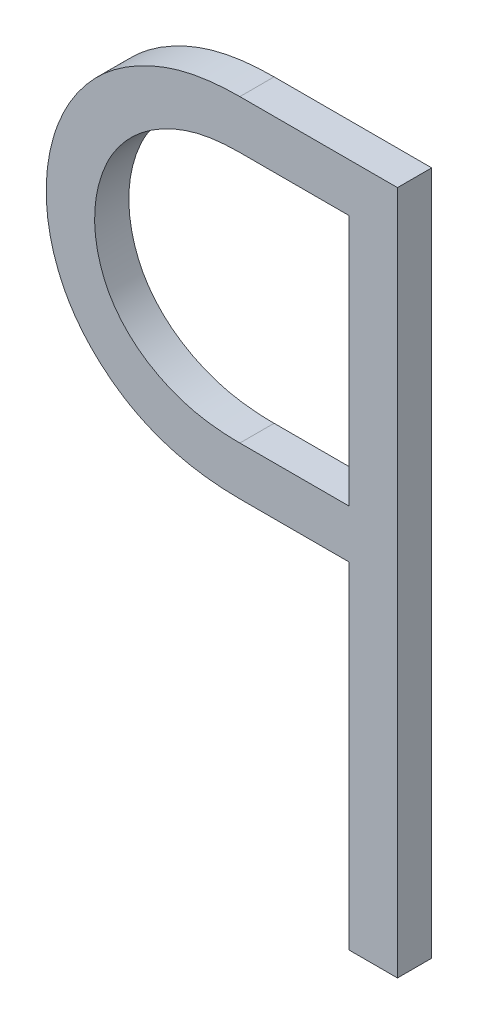
ISO-10303-21;
HEADER;
FILE_DESCRIPTION(('STEP AP214'),'2;1');
FILE_NAME('part.step','',(''),(''),'','','');
FILE_SCHEMA(('AUTOMOTIVE_DESIGN { 1 0 10303 214 1 1 1 1 }'));
ENDSEC;
DATA;
#1=APPLICATION_CONTEXT('core data for automotive mechanical design processes');
#2=APPLICATION_PROTOCOL_DEFINITION('international standard','automotive_design',2000,#1);
#3=PRODUCT_CONTEXT('',#1,'mechanical');
#4=PRODUCT('Part','Part','',(#3));
#5=PRODUCT_RELATED_PRODUCT_CATEGORY('part','',(#4));
#6=PRODUCT_DEFINITION_FORMATION('','',#4);
#7=PRODUCT_DEFINITION_CONTEXT('part definition',#1,'design');
#8=PRODUCT_DEFINITION('design','',#6,#7);
#9=PRODUCT_DEFINITION_SHAPE('','',#8);
#10=(LENGTH_UNIT() NAMED_UNIT(*) SI_UNIT(.MILLI.,.METRE.));
#11=(NAMED_UNIT(*) PLANE_ANGLE_UNIT() SI_UNIT($,.RADIAN.));
#12=(NAMED_UNIT(*) SI_UNIT($,.STERADIAN.) SOLID_ANGLE_UNIT());
#13=UNCERTAINTY_MEASURE_WITH_UNIT(LENGTH_MEASURE(1.E-05),#10,'distance_accuracy_value','');
#14=(GEOMETRIC_REPRESENTATION_CONTEXT(3) GLOBAL_UNCERTAINTY_ASSIGNED_CONTEXT((#13)) GLOBAL_UNIT_ASSIGNED_CONTEXT((#10,
#11,#12)) REPRESENTATION_CONTEXT('',''));
#15=CARTESIAN_POINT('',(0.,0.,0.));
#16=DIRECTION('',(0.,0.,1.));
#17=DIRECTION('',(1.,0.,0.));
#18=AXIS2_PLACEMENT_3D('',#15,#16,#17);
#19=CARTESIAN_POINT('',(76.9260426261496,67.2664998479739,-39.1));
#20=DIRECTION('',(0.,0.,-1.));
#21=DIRECTION('',(-1.,0.,0.));
#22=AXIS2_PLACEMENT_3D('',#19,#20,#21);
#23=PLANE('',#22);
#24=DIRECTION('',(0.,1.,0.));
#25=VECTOR('',#24,1.);
#26=CARTESIAN_POINT('',(77.8108499544903,67.6377070418411,-39.1));
#27=LINE('',#26,#25);
#28=CARTESIAN_POINT('',(77.8108499544903,66.9026168892811,-39.1));
#29=VERTEX_POINT('',#28);
#30=CARTESIAN_POINT('',(77.8108499544903,67.6377070418411,-39.1));
#31=VERTEX_POINT('',#30);
#32=EDGE_CURVE('E146',#29,#31,#27,.T.);
#33=ORIENTED_EDGE('',*,*,#32,.T.);
#34=DIRECTION('',(1.,0.,0.));
#35=VECTOR('',#34,1.);
#36=CARTESIAN_POINT('',(77.4918485674903,67.6377070418411,-39.1));
#37=LINE('',#36,#35);
#38=CARTESIAN_POINT('',(77.4918485674903,67.6377070418411,-39.1));
#39=VERTEX_POINT('',#38);
#40=EDGE_CURVE('E141',#31,#39,#37,.F.);
#41=ORIENTED_EDGE('',*,*,#40,.T.);
#42=CARTESIAN_POINT('',(77.4918485674903,67.6377070418411,-39.1));
#43=CARTESIAN_POINT('',(77.4762208817574,67.6376866803007,-39.1));
#44=CARTESIAN_POINT('',(77.4605717222054,67.6371454072403,-39.1));
#45=CARTESIAN_POINT('',(77.4293270488793,67.6347689720419,-39.1));
#46=CARTESIAN_POINT('',(77.4137318487174,67.6329298304704,-39.1));
#47=CARTESIAN_POINT('',(77.3827525701593,67.6276963614346,-39.1));
#48=CARTESIAN_POINT('',(77.367369088751,67.6242983095902,-39.1));
#49=CARTESIAN_POINT('',(77.3371259190367,67.6157260384899,-39.1));
#50=CARTESIAN_POINT('',(77.3222654478779,67.6105546102422,-39.1));
#51=CARTESIAN_POINT('',(77.2972688911199,67.6002513097865,-39.1));
#52=CARTESIAN_POINT('',(77.2869689419623,67.5955089418244,-39.1));
#53=CARTESIAN_POINT('',(77.2667544725662,67.585252221285,-39.1));
#54=CARTESIAN_POINT('',(77.2568401457307,67.5797374875592,-39.1));
#55=CARTESIAN_POINT('',(77.2374734622249,67.567978685147,-39.1));
#56=CARTESIAN_POINT('',(77.2280203703546,67.5617358347747,-39.1));
#57=CARTESIAN_POINT('',(77.2097108080388,67.5484336528131,-39.1));
#58=CARTESIAN_POINT('',(77.2008540422367,67.5413747301974,-39.1));
#59=CARTESIAN_POINT('',(77.1837488658665,67.5264340945459,-39.1));
#60=CARTESIAN_POINT('',(77.1755054227603,67.5185466982287,-39.1));
#61=CARTESIAN_POINT('',(77.159766674882,67.5020509642311,-39.1));
#62=CARTESIAN_POINT('',(77.1522717056379,67.4934423063733,-39.1));
#63=CARTESIAN_POINT('',(77.1381151728195,67.4755670742761,-39.1));
#64=CARTESIAN_POINT('',(77.1314533108176,67.4663007374993,-39.1));
#65=CARTESIAN_POINT('',(77.1190968796951,67.4471514291223,-39.1));
#66=CARTESIAN_POINT('',(77.1134017398908,67.4372688260668,-39.1));
#67=CARTESIAN_POINT('',(77.0990411476072,67.4091709528248,-39.1));
#68=CARTESIAN_POINT('',(77.091462084815,67.3903952232889,-39.1));
#69=CARTESIAN_POINT('',(77.0792276646806,67.3519246844986,-39.1));
#70=CARTESIAN_POINT('',(77.0745742682304,67.3322292683138,-39.1));
#71=CARTESIAN_POINT('',(77.0683825915336,67.2912729289179,-39.1));
#72=CARTESIAN_POINT('',(77.0670184884962,67.2699838034372,-39.1));
#73=CARTESIAN_POINT('',(77.0678206721247,67.2381443118997,-39.1));
#74=CARTESIAN_POINT('',(77.068564075093,67.2275405971294,-39.1));
#75=CARTESIAN_POINT('',(77.0710340495803,67.2064434550079,-39.1));
#76=CARTESIAN_POINT('',(77.0727607661077,67.1959500441556,-39.1));
#77=CARTESIAN_POINT('',(77.0770059429404,67.1757299018913,-39.1));
#78=CARTESIAN_POINT('',(77.0794755976556,67.1659927600491,-39.1));
#79=CARTESIAN_POINT('',(77.085211904799,67.1467574945974,-39.1));
#80=CARTESIAN_POINT('',(77.0884783746015,67.1372593167681,-39.1));
#81=CARTESIAN_POINT('',(77.0958323868188,67.1186041005317,-39.1));
#82=CARTESIAN_POINT('',(77.0999183056258,67.1094464293391,-39.1));
#83=CARTESIAN_POINT('',(77.1089818479288,67.0915777577145,-39.1));
#84=CARTESIAN_POINT('',(77.1139598738862,67.0828669611743,-39.1));
#85=CARTESIAN_POINT('',(77.1294271939834,67.0587047604191,-39.1));
#86=CARTESIAN_POINT('',(77.140967658508,67.0439172104791,-39.1));
#87=CARTESIAN_POINT('',(77.166329067515,67.0164447413071,-39.1));
#88=CARTESIAN_POINT('',(77.1801526914875,67.0037623281264,-39.1));
#89=CARTESIAN_POINT('',(77.2038890080289,66.985271036118,-39.1));
#90=CARTESIAN_POINT('',(77.213225100232,66.9787101622734,-39.1));
#91=CARTESIAN_POINT('',(77.2324346018881,66.966459028946,-39.1));
#92=CARTESIAN_POINT('',(77.2423076121717,66.9607681343598,-39.1));
#93=CARTESIAN_POINT('',(77.2726019970348,66.9448022608495,-39.1));
#94=CARTESIAN_POINT('',(77.2936483418778,66.9356712816214,-39.1));
#95=CARTESIAN_POINT('',(77.3294771046156,66.9234728531023,-39.1));
#96=CARTESIAN_POINT('',(77.3439266189023,66.9193999983895,-39.1));
#97=CARTESIAN_POINT('',(77.3731863850453,66.912740694325,-39.1));
#98=CARTESIAN_POINT('',(77.3879972051787,66.9101567681489,-39.1));
#99=CARTESIAN_POINT('',(77.4176490786604,66.9061992517294,-39.1));
#100=CARTESIAN_POINT('',(77.4324889590352,66.9048162178683,-39.1));
#101=CARTESIAN_POINT('',(77.4621728166904,66.9030336956379,-39.1));
#102=CARTESIAN_POINT('',(77.4770165608049,66.9026304623116,-39.1));
#103=CARTESIAN_POINT('',(77.4918485674903,66.9026168892811,-39.1));
#104=B_SPLINE_CURVE_WITH_KNOTS('',3,(#42,#43,#44,#45,#46,#47,#48,#49,#50,#51,#52,#53,#54,#55,
#56,#57,#58,#59,#60,#61,#62,#63,#64,#65,#66,#67,#68,#69,#70,#71,#72,#73,#74,#75,#76,#77,#78,#79,
#80,#81,#82,#83,#84,#85,#86,#87,#88,#89,#90,#91,#92,#93,#94,#95,#96,#97,#98,#99,#100,#101,#102,
#103),.UNSPECIFIED.,.F.,.F.,(4,2,2,2,2,2,2,2,2,2,2,2,2,2,2,2,2,2,2,2,2,2,2,2,2,2,2,2,2,2,4),(0.,
0.0469077457777351,0.0939599452368748,0.141125146879454,0.188216456222583,0.222202569825216,
0.256205514442229,0.290152358861946,0.324082264013561,0.358262361672605,0.392457713543742,
0.426640780994162,0.460803598494105,0.521253411282166,0.581743696743869,0.645372894129386,
0.677225233949616,0.709082272227655,0.739185993389166,0.769282821410713,0.799320596231221,
0.82937195643646,0.885333952449467,0.941362097684288,0.975545053291957,1.00970293420558,
1.07820472165069,1.12316564246539,1.16820253279484,1.21288196693405,1.25739035849552),.UNSPECIFIED.);
#105=CARTESIAN_POINT('',(77.4918485674903,66.9026168892811,-39.1));
#106=VERTEX_POINT('',#105);
#107=EDGE_CURVE('E129',#39,#106,#104,.T.);
#108=ORIENTED_EDGE('',*,*,#107,.T.);
#109=DIRECTION('',(1.,0.,0.));
#110=VECTOR('',#109,1.);
#111=CARTESIAN_POINT('',(77.8108499544903,66.9026168892811,-39.1));
#112=LINE('',#111,#110);
#113=EDGE_CURVE('E158',#106,#29,#112,.T.);
#114=ORIENTED_EDGE('',*,*,#113,.T.);
#115=EDGE_LOOP('',(#33,#41,#108,#114));
#116=FACE_BOUND('',#115,.T.);
#117=DIRECTION('',(0.,1.,0.));
#118=VECTOR('',#117,1.);
#119=CARTESIAN_POINT('',(77.8108499544903,66.7611467089711,-39.1));
#120=LINE('',#119,#118);
#121=CARTESIAN_POINT('',(77.8108499544903,65.7791772221511,-39.1));
#122=VERTEX_POINT('',#121);
#123=CARTESIAN_POINT('',(77.8108499544903,66.7611467089711,-39.1));
#124=VERTEX_POINT('',#123);
#125=EDGE_CURVE('E92',#122,#124,#120,.T.);
#126=ORIENTED_EDGE('',*,*,#125,.T.);
#127=DIRECTION('',(1.,0.,0.));
#128=VECTOR('',#127,1.);
#129=CARTESIAN_POINT('',(77.4918485674903,66.7611467089711,-39.1));
#130=LINE('',#129,#128);
#131=CARTESIAN_POINT('',(77.4918485674903,66.7611467089711,-39.1));
#132=VERTEX_POINT('',#131);
#133=EDGE_CURVE('E76',#124,#132,#130,.F.);
#134=ORIENTED_EDGE('',*,*,#133,.T.);
#135=CARTESIAN_POINT('',(77.4918485674903,66.7611467089711,-39.1));
#136=CARTESIAN_POINT('',(77.4583150219114,66.7611166911419,-39.1));
#137=CARTESIAN_POINT('',(77.4246540486719,66.7629795978468,-39.1));
#138=CARTESIAN_POINT('',(77.357694158688,66.7713695903653,-39.1));
#139=CARTESIAN_POINT('',(77.3243995979946,66.7779301850173,-39.1));
#140=CARTESIAN_POINT('',(77.2589904638447,66.7967072865847,-39.1));
#141=CARTESIAN_POINT('',(77.2268899848779,66.808976565224,-39.1));
#142=CARTESIAN_POINT('',(77.1811219967963,66.8319629171451,-39.1));
#143=CARTESIAN_POINT('',(77.1662738534427,66.8403803669375,-39.1));
#144=CARTESIAN_POINT('',(77.1374847247786,66.8586560868082,-39.1));
#145=CARTESIAN_POINT('',(77.12354388872,66.8685145930788,-39.1));
#146=CARTESIAN_POINT('',(77.0982890552215,66.8883043775588,-39.1));
#147=CARTESIAN_POINT('',(77.0868595083178,66.8980887027619,-39.1));
#148=CARTESIAN_POINT('',(77.0648889995586,66.9185995098753,-39.1));
#149=CARTESIAN_POINT('',(77.0543479345817,66.9293258821512,-39.1));
#150=CARTESIAN_POINT('',(77.0243086457496,66.9629098829416,-39.1));
#151=CARTESIAN_POINT('',(77.0063495004421,66.9872068220598,-39.1));
#152=CARTESIAN_POINT('',(76.9772565694574,67.0365326877421,-39.1));
#153=CARTESIAN_POINT('',(76.9656416065999,67.0612807492708,-39.1));
#154=CARTESIAN_POINT('',(76.9467535139381,67.1123474160348,-39.1));
#155=CARTESIAN_POINT('',(76.939482493421,67.1386667774346,-39.1));
#156=CARTESIAN_POINT('',(76.9247390256455,67.2172831956499,-39.1));
#157=CARTESIAN_POINT('',(76.9234169920289,67.2708911419374,-39.1));
#158=CARTESIAN_POINT('',(76.9337538921444,67.3513849950959,-39.1));
#159=CARTESIAN_POINT('',(76.9397052745178,67.3791886683101,-39.1));
#160=CARTESIAN_POINT('',(76.9518709611044,67.4199278818627,-39.1));
#161=CARTESIAN_POINT('',(76.9564672705056,67.4333493000526,-39.1));
#162=CARTESIAN_POINT('',(76.9667203441332,67.459800643536,-39.1));
#163=CARTESIAN_POINT('',(76.972378370545,67.4728300812217,-39.1));
#164=CARTESIAN_POINT('',(76.9850447123965,67.498861648072,-39.1));
#165=CARTESIAN_POINT('',(76.9920976003726,67.5118422943427,-39.1));
#166=CARTESIAN_POINT('',(77.0073591204979,67.5371073324496,-39.1));
#167=CARTESIAN_POINT('',(77.0155685212762,67.549391253558,-39.1));
#168=CARTESIAN_POINT('',(77.0417385100457,67.5851008067874,-39.1));
#169=CARTESIAN_POINT('',(77.0612614836352,67.6074257488227,-39.1));
#170=CARTESIAN_POINT('',(77.0926988663279,67.6374526508797,-39.1));
#171=CARTESIAN_POINT('',(77.103211780164,67.6466681101482,-39.1));
#172=CARTESIAN_POINT('',(77.1249938731413,67.6641388445071,-39.1));
#173=CARTESIAN_POINT('',(77.1362622493845,67.6723951142812,-39.1));
#174=CARTESIAN_POINT('',(77.1594167287992,67.6879985785382,-39.1));
#175=CARTESIAN_POINT('',(77.1713032142598,67.6953452006925,-39.1));
#176=CARTESIAN_POINT('',(77.195557121665,67.7091999404789,-39.1));
#177=CARTESIAN_POINT('',(77.2079247944384,67.7157076129566,-39.1));
#178=CARTESIAN_POINT('',(77.2474565544766,67.7347115303954,-39.1));
#179=CARTESIAN_POINT('',(77.275438280841,67.7455924055964,-39.1));
#180=CARTESIAN_POINT('',(77.3184274628442,67.7583359876063,-39.1));
#181=CARTESIAN_POINT('',(77.3329315456692,67.7619881701008,-39.1));
#182=CARTESIAN_POINT('',(77.3621837916311,67.7681496579084,-39.1));
#183=CARTESIAN_POINT('',(77.3769319926878,67.7706587839059,-39.1));
#184=CARTESIAN_POINT('',(77.4083482312896,67.7749231403598,-39.1));
#185=CARTESIAN_POINT('',(77.4250330388996,67.7765507425921,-39.1));
#186=CARTESIAN_POINT('',(77.4584311872869,67.77867562853,-39.1));
#187=CARTESIAN_POINT('',(77.4751443329873,67.7791759180983,-39.1));
#188=CARTESIAN_POINT('',(77.4918485674903,67.7791772221511,-39.1));
#189=B_SPLINE_CURVE_WITH_KNOTS('',3,(#135,#136,#137,#138,#139,#140,#141,#142,#143,#144,#145,
#146,#147,#148,#149,#150,#151,#152,#153,#154,#155,#156,#157,#158,#159,#160,#161,#162,#163,#164,
#165,#166,#167,#168,#169,#170,#171,#172,#173,#174,#175,#176,#177,#178,#179,#180,#181,#182,#183,
#184,#185,#186,#187,#188),.UNSPECIFIED.,.F.,.F.,(4,2,2,2,2,2,2,2,2,2,2,2,2,2,2,2,2,2,2,2,2,2,2,
2,2,2,4),(0.,0.10073389832514,0.202193587323596,0.304610405634814,0.355738550707682,
0.406875085209701,0.451954192306461,0.497028060084448,0.587008612760712,0.668575739976154,
0.750182441600612,0.9079831330209,0.99298021116439,1.03549669485339,1.07806404672531,
1.12231582888519,1.16659716116279,1.25502249702713,1.29692200800719,1.33877767367722,
1.38065954154402,1.42256354164073,1.51216684414804,1.55699790907416,1.60183600439782,
1.65208865811219,1.70220715895614),.UNSPECIFIED.);
#190=CARTESIAN_POINT('',(77.4918485674903,67.7791772221511,-39.1));
#191=VERTEX_POINT('',#190);
#192=EDGE_CURVE('E24',#132,#191,#189,.T.);
#193=ORIENTED_EDGE('',*,*,#192,.T.);
#194=DIRECTION('',(1.,0.,0.));
#195=VECTOR('',#194,1.);
#196=CARTESIAN_POINT('',(77.9523201347903,67.7791772221511,-39.1));
#197=LINE('',#196,#195);
#198=CARTESIAN_POINT('',(77.9523201347903,67.7791772221511,-39.1));
#199=VERTEX_POINT('',#198);
#200=EDGE_CURVE('E86',#191,#199,#197,.T.);
#201=ORIENTED_EDGE('',*,*,#200,.T.);
#202=DIRECTION('',(0.,1.,0.));
#203=VECTOR('',#202,1.);
#204=CARTESIAN_POINT('',(77.9523201347903,65.7791772221511,-39.1));
#205=LINE('',#204,#203);
#206=CARTESIAN_POINT('',(77.9523201347903,65.7791772221511,-39.1));
#207=VERTEX_POINT('',#206);
#208=EDGE_CURVE('E113',#199,#207,#205,.F.);
#209=ORIENTED_EDGE('',*,*,#208,.T.);
#210=DIRECTION('',(1.,0.,0.));
#211=VECTOR('',#210,1.);
#212=CARTESIAN_POINT('',(77.8108499544903,65.7791772221511,-39.1));
#213=LINE('',#212,#211);
#214=EDGE_CURVE('E179',#207,#122,#213,.F.);
#215=ORIENTED_EDGE('',*,*,#214,.T.);
#216=EDGE_LOOP('',(#126,#134,#193,#201,#209,#215));
#217=FACE_BOUND('',#216,.T.);
#218=ADVANCED_FACE('F17',(#116,#217),#23,.T.);
#219=CARTESIAN_POINT('',(77.9523201347903,67.7791772221511,-39.));
#220=DIRECTION('',(0.,-1.,0.));
#221=DIRECTION('',(0.,0.,-1.));
#222=AXIS2_PLACEMENT_3D('',#219,#220,#221);
#223=PLANE('',#222);
#224=DIRECTION('',(0.,0.,1.));
#225=VECTOR('',#224,1.);
#226=CARTESIAN_POINT('',(77.4918485674903,67.7791772221511,-39.05));
#227=LINE('',#226,#225);
#228=CARTESIAN_POINT('',(77.4918485674903,67.7791772221511,-39.));
#229=VERTEX_POINT('',#228);
#230=EDGE_CURVE('E127',#191,#229,#227,.T.);
#231=ORIENTED_EDGE('',*,*,#230,.T.);
#232=DIRECTION('',(-1.,0.,0.));
#233=VECTOR('',#232,1.);
#234=CARTESIAN_POINT('',(76.9260426261496,67.7791772221511,-39.));
#235=LINE('',#234,#233);
#236=CARTESIAN_POINT('',(77.9523201347903,67.7791772221511,-39.));
#237=VERTEX_POINT('',#236);
#238=EDGE_CURVE('E121',#229,#237,#235,.F.);
#239=ORIENTED_EDGE('',*,*,#238,.T.);
#240=DIRECTION('',(0.,0.,1.));
#241=VECTOR('',#240,1.);
#242=CARTESIAN_POINT('',(77.9523201347903,67.7791772221511,-39.));
#243=LINE('',#242,#241);
#244=EDGE_CURVE('E108',#237,#199,#243,.F.);
#245=ORIENTED_EDGE('',*,*,#244,.T.);
#246=ORIENTED_EDGE('',*,*,#200,.F.);
#247=EDGE_LOOP('',(#231,#239,#245,#246));
#248=FACE_BOUND('',#247,.T.);
#249=ADVANCED_FACE('F126',(#248),#223,.F.);
#250=CARTESIAN_POINT('',(77.9523201347903,65.7791772221511,-39.));
#251=DIRECTION('',(-1.,0.,0.));
#252=DIRECTION('',(0.,0.,1.));
#253=AXIS2_PLACEMENT_3D('',#250,#251,#252);
#254=PLANE('',#253);
#255=ORIENTED_EDGE('',*,*,#244,.F.);
#256=DIRECTION('',(0.,1.,0.));
#257=VECTOR('',#256,1.);
#258=CARTESIAN_POINT('',(77.9523201347903,67.2664998479739,-39.));
#259=LINE('',#258,#257);
#260=CARTESIAN_POINT('',(77.9523201347903,65.7791772221511,-39.));
#261=VERTEX_POINT('',#260);
#262=EDGE_CURVE('E112',#237,#261,#259,.F.);
#263=ORIENTED_EDGE('',*,*,#262,.T.);
#264=DIRECTION('',(0.,0.,1.));
#265=VECTOR('',#264,1.);
#266=CARTESIAN_POINT('',(77.9523201347903,65.7791772221511,-39.));
#267=LINE('',#266,#265);
#268=EDGE_CURVE('E185',#261,#207,#267,.F.);
#269=ORIENTED_EDGE('',*,*,#268,.T.);
#270=ORIENTED_EDGE('',*,*,#208,.F.);
#271=EDGE_LOOP('',(#255,#263,#269,#270));
#272=FACE_BOUND('',#271,.T.);
#273=ADVANCED_FACE('F110',(#272),#254,.F.);
#274=CARTESIAN_POINT('',(77.8108499544903,65.7791772221511,-39.));
#275=DIRECTION('',(0.,1.,0.));
#276=DIRECTION('',(0.,0.,1.));
#277=AXIS2_PLACEMENT_3D('',#274,#275,#276);
#278=PLANE('',#277);
#279=ORIENTED_EDGE('',*,*,#268,.F.);
#280=DIRECTION('',(-1.,0.,0.));
#281=VECTOR('',#280,1.);
#282=CARTESIAN_POINT('',(76.9260426261496,65.7791772221511,-39.));
#283=LINE('',#282,#281);
#284=CARTESIAN_POINT('',(77.8108499544903,65.7791772221511,-39.));
#285=VERTEX_POINT('',#284);
#286=EDGE_CURVE('E124',#261,#285,#283,.T.);
#287=ORIENTED_EDGE('',*,*,#286,.T.);
#288=DIRECTION('',(0.,0.,-1.));
#289=VECTOR('',#288,1.);
#290=CARTESIAN_POINT('',(77.8108499544903,65.7791772221511,-39.));
#291=LINE('',#290,#289);
#292=EDGE_CURVE('E176',#285,#122,#291,.T.);
#293=ORIENTED_EDGE('',*,*,#292,.T.);
#294=ORIENTED_EDGE('',*,*,#214,.F.);
#295=EDGE_LOOP('',(#279,#287,#293,#294));
#296=FACE_BOUND('',#295,.T.);
#297=ADVANCED_FACE('F253',(#296),#278,.F.);
#298=CARTESIAN_POINT('',(77.8108499544903,66.7611467089711,-39.));
#299=DIRECTION('',(1.,0.,0.));
#300=DIRECTION('',(0.,0.,-1.));
#301=AXIS2_PLACEMENT_3D('',#298,#299,#300);
#302=PLANE('',#301);
#303=ORIENTED_EDGE('',*,*,#292,.F.);
#304=DIRECTION('',(0.,1.,0.));
#305=VECTOR('',#304,1.);
#306=CARTESIAN_POINT('',(77.8108499544903,67.2664998479739,-39.));
#307=LINE('',#306,#305);
#308=CARTESIAN_POINT('',(77.8108499544903,66.7611467089711,-39.));
#309=VERTEX_POINT('',#308);
#310=EDGE_CURVE('E170',#285,#309,#307,.T.);
#311=ORIENTED_EDGE('',*,*,#310,.T.);
#312=DIRECTION('',(0.,0.,1.));
#313=VECTOR('',#312,1.);
#314=CARTESIAN_POINT('',(77.8108499544903,66.7611467089711,-39.));
#315=LINE('',#314,#313);
#316=EDGE_CURVE('E165',#309,#124,#315,.F.);
#317=ORIENTED_EDGE('',*,*,#316,.T.);
#318=ORIENTED_EDGE('',*,*,#125,.F.);
#319=EDGE_LOOP('',(#303,#311,#317,#318));
#320=FACE_BOUND('',#319,.T.);
#321=ADVANCED_FACE('F249',(#320),#302,.F.);
#322=CARTESIAN_POINT('',(77.4918485674903,66.7611467089711,-39.));
#323=DIRECTION('',(0.,1.,0.));
#324=DIRECTION('',(0.,0.,1.));
#325=AXIS2_PLACEMENT_3D('',#322,#323,#324);
#326=PLANE('',#325);
#327=ORIENTED_EDGE('',*,*,#316,.F.);
#328=DIRECTION('',(-1.,0.,0.));
#329=VECTOR('',#328,1.);
#330=CARTESIAN_POINT('',(76.9260426261496,66.7611467089711,-39.));
#331=LINE('',#330,#329);
#332=CARTESIAN_POINT('',(77.4918485674903,66.7611467089711,-39.));
#333=VERTEX_POINT('',#332);
#334=EDGE_CURVE('E173',#309,#333,#331,.T.);
#335=ORIENTED_EDGE('',*,*,#334,.T.);
#336=DIRECTION('',(0.,0.,-1.));
#337=VECTOR('',#336,1.);
#338=CARTESIAN_POINT('',(77.4918485674903,66.7611467089711,-39.05));
#339=LINE('',#338,#337);
#340=EDGE_CURVE('E162',#333,#132,#339,.T.);
#341=ORIENTED_EDGE('',*,*,#340,.T.);
#342=ORIENTED_EDGE('',*,*,#133,.F.);
#343=EDGE_LOOP('',(#327,#335,#341,#342));
#344=FACE_BOUND('',#343,.T.);
#345=ADVANCED_FACE('F246',(#344),#326,.F.);
#346=CARTESIAN_POINT('',(77.4918485674903,67.7791772221511,-39.));
#347=CARTESIAN_POINT('',(77.4918485674903,67.7791772221511,-39.1));
#348=CARTESIAN_POINT('',(77.4621602280903,67.7791772221511,-39.));
#349=CARTESIAN_POINT('',(77.4621602280903,67.7791772221511,-39.1));
#350=CARTESIAN_POINT('',(77.4046584638903,67.7761162071711,-39.));
#351=CARTESIAN_POINT('',(77.4046584638903,67.7761162071711,-39.1));
#352=CARTESIAN_POINT('',(77.3219780322903,67.7611683956811,-39.));
#353=CARTESIAN_POINT('',(77.3219780322903,67.7611683956811,-39.1));
#354=CARTESIAN_POINT('',(77.2468435475903,67.7355075733911,-39.));
#355=CARTESIAN_POINT('',(77.2468435475903,67.7355075733911,-39.1));
#356=CARTESIAN_POINT('',(77.1795273056903,67.7017449974511,-39.));
#357=CARTESIAN_POINT('',(77.1795273056903,67.7017449974511,-39.1));
#358=CARTESIAN_POINT('',(77.1196209124903,67.6619214727711,-39.));
#359=CARTESIAN_POINT('',(77.1196209124903,67.6619214727711,-39.1));
#360=CARTESIAN_POINT('',(77.0681033231903,67.6156172297611,-39.));
#361=CARTESIAN_POINT('',(77.0681033231903,67.6156172297611,-39.1));
#362=CARTESIAN_POINT('',(77.0245861992903,67.5641209164811,-39.));
#363=CARTESIAN_POINT('',(77.0245861992903,67.5641209164811,-39.1));
#364=CARTESIAN_POINT('',(76.9885811501903,67.5082000678811,-39.));
#365=CARTESIAN_POINT('',(76.9885811501903,67.5082000678811,-39.1));
#366=CARTESIAN_POINT('',(76.9608145262903,67.4483150175911,-39.));
#367=CARTESIAN_POINT('',(76.9608145262903,67.4483150175911,-39.1));
#368=CARTESIAN_POINT('',(76.9408007048903,67.3859588574211,-39.));
#369=CARTESIAN_POINT('',(76.9408007048903,67.3859588574211,-39.1));
#370=CARTESIAN_POINT('',(76.9286244076903,67.3221387096011,-39.));
#371=CARTESIAN_POINT('',(76.9286244076903,67.3221387096011,-39.1));
#372=CARTESIAN_POINT('',(76.9246502912903,67.2578344576011,-39.));
#373=CARTESIAN_POINT('',(76.9246502912903,67.2578344576011,-39.1));
#374=CARTESIAN_POINT('',(76.9285665572903,67.1939771780511,-39.));
#375=CARTESIAN_POINT('',(76.9285665572903,67.1939771780511,-39.1));
#376=CARTESIAN_POINT('',(76.9406957130903,67.1315022982211,-39.));
#377=CARTESIAN_POINT('',(76.9406957130903,67.1315022982211,-39.1));
#378=CARTESIAN_POINT('',(76.9607342610903,67.0712334381311,-39.));
#379=CARTESIAN_POINT('',(76.9607342610903,67.0712334381311,-39.1));
#380=CARTESIAN_POINT('',(76.9887822936903,67.0139345109911,-39.));
#381=CARTESIAN_POINT('',(76.9887822936903,67.0139345109911,-39.1));
#382=CARTESIAN_POINT('',(77.0252964462903,66.9607344917511,-39.));
#383=CARTESIAN_POINT('',(77.0252964462903,66.9607344917511,-39.1));
#384=CARTESIAN_POINT('',(77.0870737382903,66.8932449539811,-39.));
#385=CARTESIAN_POINT('',(77.0870737382903,66.8932449539811,-39.1));
#386=CARTESIAN_POINT('',(77.1855075067903,66.8217804788611,-39.));
#387=CARTESIAN_POINT('',(77.1855075067903,66.8217804788611,-39.1));
#388=CARTESIAN_POINT('',(77.3315853710903,66.7705889554111,-39.));
#389=CARTESIAN_POINT('',(77.3315853710903,66.7705889554111,-39.1));
#390=CARTESIAN_POINT('',(77.4369006567903,66.7611467089711,-39.));
#391=CARTESIAN_POINT('',(77.4369006567903,66.7611467089711,-39.1));
#392=CARTESIAN_POINT('',(77.4918485674903,66.7611467089711,-39.));
#393=CARTESIAN_POINT('',(77.4918485674903,66.7611467089711,-39.1));
#394=B_SPLINE_SURFACE_WITH_KNOTS('',3,1,((#346,#347),(#348,#349),(#350,#351),(#352,#353),(#354,
#355),(#356,#357),(#358,#359),(#360,#361),(#362,#363),(#364,#365),(#366,#367),(#368,#369),(#370,
#371),(#372,#373),(#374,#375),(#376,#377),(#378,#379),(#380,#381),(#382,#383),(#384,#385),(#386,
#387),(#388,#389),(#390,#391),(#392,#393)),.UNSPECIFIED.,.F.,.F.,.F.,(4,1,1,1,1,1,1,1,1,1,1,1,1,
1,1,1,1,1,1,1,1,4),(2,2),(0.,0.0523334172837,0.1012446402993,0.1476339005722,0.1917742385818,
0.233665297503,0.2740624959879,0.3134480998412,0.3521804118246,0.390949118609,0.4294653200465,
0.4673461414116,0.5051793125637,0.5427413604491,0.5798218237005,0.6170470640946,0.6543849112301,
0.6919085199458,0.7303679457103,0.8153173170425,0.90314002082984,1.),(1.,1.1),.UNSPECIFIED.);
#395=CARTESIAN_POINT('',(77.4918485674903,66.7611467089711,-39.));
#396=CARTESIAN_POINT('',(77.4583150219114,66.7611166911419,-39.));
#397=CARTESIAN_POINT('',(77.4246540486719,66.7629795978468,-39.));
#398=CARTESIAN_POINT('',(77.357694158688,66.7713695903653,-39.));
#399=CARTESIAN_POINT('',(77.3243995979946,66.7779301850173,-39.));
#400=CARTESIAN_POINT('',(77.2589904638447,66.7967072865847,-39.));
#401=CARTESIAN_POINT('',(77.2268899848779,66.8089765652241,-39.));
#402=CARTESIAN_POINT('',(77.1811219967963,66.8319629171451,-39.));
#403=CARTESIAN_POINT('',(77.1662738534427,66.8403803669375,-39.));
#404=CARTESIAN_POINT('',(77.1374847247785,66.8586560868082,-39.));
#405=CARTESIAN_POINT('',(77.12354388872,66.8685145930788,-39.));
#406=CARTESIAN_POINT('',(77.0982890552215,66.8883043775588,-39.));
#407=CARTESIAN_POINT('',(77.0868595083178,66.8980887027618,-39.));
#408=CARTESIAN_POINT('',(77.0648889995586,66.9185995098752,-39.));
#409=CARTESIAN_POINT('',(77.0543479345817,66.9293258821512,-39.));
#410=CARTESIAN_POINT('',(77.0243086457496,66.9629098829416,-39.));
#411=CARTESIAN_POINT('',(77.0063495004421,66.9872068220598,-39.));
#412=CARTESIAN_POINT('',(76.9772565694574,67.0365326877421,-39.));
#413=CARTESIAN_POINT('',(76.9656416065999,67.0612807492708,-39.));
#414=CARTESIAN_POINT('',(76.9467535139381,67.1123474160349,-39.));
#415=CARTESIAN_POINT('',(76.939482493421,67.1386667774346,-39.));
#416=CARTESIAN_POINT('',(76.9247390256454,67.2172831956499,-39.));
#417=CARTESIAN_POINT('',(76.9234169920289,67.2708911419374,-39.));
#418=CARTESIAN_POINT('',(76.9337538921444,67.3513849950959,-39.));
#419=CARTESIAN_POINT('',(76.9397052745178,67.3791886683101,-39.));
#420=CARTESIAN_POINT('',(76.9518709611044,67.4199278818627,-39.));
#421=CARTESIAN_POINT('',(76.9564672705056,67.4333493000526,-39.));
#422=CARTESIAN_POINT('',(76.9667203441332,67.459800643536,-39.));
#423=CARTESIAN_POINT('',(76.972378370545,67.4728300812217,-39.));
#424=CARTESIAN_POINT('',(76.9850447123965,67.498861648072,-39.));
#425=CARTESIAN_POINT('',(76.9920976003726,67.5118422943427,-39.));
#426=CARTESIAN_POINT('',(77.0073591204979,67.5371073324496,-39.));
#427=CARTESIAN_POINT('',(77.0155685212762,67.549391253558,-39.));
#428=CARTESIAN_POINT('',(77.0417385100457,67.5851008067874,-39.));
#429=CARTESIAN_POINT('',(77.0612614836352,67.6074257488227,-39.));
#430=CARTESIAN_POINT('',(77.0926988663279,67.6374526508797,-39.));
#431=CARTESIAN_POINT('',(77.103211780164,67.6466681101482,-39.));
#432=CARTESIAN_POINT('',(77.1249938731413,67.6641388445071,-39.));
#433=CARTESIAN_POINT('',(77.1362622493845,67.6723951142812,-39.));
#434=CARTESIAN_POINT('',(77.1594167287992,67.6879985785382,-39.));
#435=CARTESIAN_POINT('',(77.1713032142598,67.6953452006925,-39.));
#436=CARTESIAN_POINT('',(77.195557121665,67.7091999404789,-39.));
#437=CARTESIAN_POINT('',(77.2079247944384,67.7157076129566,-39.));
#438=CARTESIAN_POINT('',(77.2474565544765,67.7347115303953,-39.));
#439=CARTESIAN_POINT('',(77.2754382808409,67.7455924055963,-39.));
#440=CARTESIAN_POINT('',(77.3184274628439,67.7583359876062,-39.));
#441=CARTESIAN_POINT('',(77.3329315456689,67.7619881701008,-39.));
#442=CARTESIAN_POINT('',(77.3621837916307,67.7681496579083,-39.));
#443=CARTESIAN_POINT('',(77.3769319926873,67.7706587839058,-39.));
#444=CARTESIAN_POINT('',(77.4083482312892,67.7749231403597,-39.));
#445=CARTESIAN_POINT('',(77.4250330388992,67.7765507425921,-39.));
#446=CARTESIAN_POINT('',(77.4584311872868,67.77867562853,-39.));
#447=CARTESIAN_POINT('',(77.4751443329872,67.7791759180983,-39.));
#448=CARTESIAN_POINT('',(77.4918485674903,67.7791772221511,-39.));
#449=B_SPLINE_CURVE_WITH_KNOTS('',3,(#395,#396,#397,#398,#399,#400,#401,#402,#403,#404,#405,
#406,#407,#408,#409,#410,#411,#412,#413,#414,#415,#416,#417,#418,#419,#420,#421,#422,#423,#424,
#425,#426,#427,#428,#429,#430,#431,#432,#433,#434,#435,#436,#437,#438,#439,#440,#441,#442,#443,
#444,#445,#446,#447,#448),.UNSPECIFIED.,.F.,.F.,(4,2,2,2,2,2,2,2,2,2,2,2,2,2,2,2,2,2,2,2,2,2,2,
2,2,2,4),(0.,0.100733898325139,0.202193587323598,0.304610405634816,0.355738550707694,
0.406875085209707,0.451954192306468,0.497028060084456,0.587008612760717,0.668575739976165,
0.750182441600614,0.907983133020901,0.992980211164391,1.03549669485339,1.07806404672531,
1.12231582888519,1.1665971611628,1.25502249702713,1.2969220080072,1.33877767367721,
1.38065954154402,1.42256354164073,1.51216684414779,1.55699790907379,1.60183600439731,
1.65208865811194,1.70220715895614),.UNSPECIFIED.);
#450=EDGE_CURVE('E223',#333,#229,#449,.T.);
#451=ORIENTED_EDGE('',*,*,#340,.F.);
#452=ORIENTED_EDGE('',*,*,#450,.T.);
#453=ORIENTED_EDGE('',*,*,#230,.F.);
#454=ORIENTED_EDGE('',*,*,#192,.F.);
#455=EDGE_LOOP('',(#451,#452,#453,#454));
#456=FACE_BOUND('',#455,.T.);
#457=ADVANCED_FACE('F244',(#456),#394,.F.);
#458=CARTESIAN_POINT('',(77.8108499544903,66.9026168892811,-39.));
#459=DIRECTION('',(0.,-1.,0.));
#460=DIRECTION('',(0.,0.,-1.));
#461=AXIS2_PLACEMENT_3D('',#458,#459,#460);
#462=PLANE('',#461);
#463=DIRECTION('',(0.,0.,1.));
#464=VECTOR('',#463,1.);
#465=CARTESIAN_POINT('',(77.4918485674903,66.9026168892811,-39.05));
#466=LINE('',#465,#464);
#467=CARTESIAN_POINT('',(77.4918485674903,66.9026168892811,-39.));
#468=VERTEX_POINT('',#467);
#469=EDGE_CURVE('E138',#106,#468,#466,.T.);
#470=ORIENTED_EDGE('',*,*,#469,.T.);
#471=DIRECTION('',(-1.,0.,0.));
#472=VECTOR('',#471,1.);
#473=CARTESIAN_POINT('',(76.9260426261496,66.9026168892811,-39.));
#474=LINE('',#473,#472);
#475=CARTESIAN_POINT('',(77.8108499544903,66.9026168892811,-39.));
#476=VERTEX_POINT('',#475);
#477=EDGE_CURVE('E152',#468,#476,#474,.F.);
#478=ORIENTED_EDGE('',*,*,#477,.T.);
#479=DIRECTION('',(0.,0.,-1.));
#480=VECTOR('',#479,1.);
#481=CARTESIAN_POINT('',(77.8108499544903,66.9026168892811,-39.));
#482=LINE('',#481,#480);
#483=EDGE_CURVE('E155',#476,#29,#482,.T.);
#484=ORIENTED_EDGE('',*,*,#483,.T.);
#485=ORIENTED_EDGE('',*,*,#113,.F.);
#486=EDGE_LOOP('',(#470,#478,#484,#485));
#487=FACE_BOUND('',#486,.T.);
#488=ADVANCED_FACE('F240',(#487),#462,.F.);
#489=CARTESIAN_POINT('',(77.8108499544903,67.6377070418411,-39.));
#490=DIRECTION('',(1.,0.,0.));
#491=DIRECTION('',(0.,0.,-1.));
#492=AXIS2_PLACEMENT_3D('',#489,#490,#491);
#493=PLANE('',#492);
#494=ORIENTED_EDGE('',*,*,#483,.F.);
#495=DIRECTION('',(0.,1.,0.));
#496=VECTOR('',#495,1.);
#497=CARTESIAN_POINT('',(77.8108499544903,67.2664998479739,-39.));
#498=LINE('',#497,#496);
#499=CARTESIAN_POINT('',(77.8108499544903,67.6377070418411,-39.));
#500=VERTEX_POINT('',#499);
#501=EDGE_CURVE('E149',#476,#500,#498,.T.);
#502=ORIENTED_EDGE('',*,*,#501,.T.);
#503=DIRECTION('',(0.,0.,1.));
#504=VECTOR('',#503,1.);
#505=CARTESIAN_POINT('',(77.8108499544903,67.6377070418411,-39.));
#506=LINE('',#505,#504);
#507=EDGE_CURVE('E143',#500,#31,#506,.F.);
#508=ORIENTED_EDGE('',*,*,#507,.T.);
#509=ORIENTED_EDGE('',*,*,#32,.F.);
#510=EDGE_LOOP('',(#494,#502,#508,#509));
#511=FACE_BOUND('',#510,.T.);
#512=ADVANCED_FACE('F236',(#511),#493,.F.);
#513=CARTESIAN_POINT('',(77.4918485674903,67.6377070418411,-39.));
#514=DIRECTION('',(0.,1.,0.));
#515=DIRECTION('',(0.,0.,1.));
#516=AXIS2_PLACEMENT_3D('',#513,#514,#515);
#517=PLANE('',#516);
#518=ORIENTED_EDGE('',*,*,#507,.F.);
#519=DIRECTION('',(-1.,0.,0.));
#520=VECTOR('',#519,1.);
#521=CARTESIAN_POINT('',(76.9260426261496,67.6377070418411,-39.));
#522=LINE('',#521,#520);
#523=CARTESIAN_POINT('',(77.4918485674903,67.6377070418411,-39.));
#524=VERTEX_POINT('',#523);
#525=EDGE_CURVE('E35',#500,#524,#522,.T.);
#526=ORIENTED_EDGE('',*,*,#525,.T.);
#527=DIRECTION('',(0.,0.,-1.));
#528=VECTOR('',#527,1.);
#529=CARTESIAN_POINT('',(77.4918485674903,67.6377070418411,-39.05));
#530=LINE('',#529,#528);
#531=EDGE_CURVE('E43',#524,#39,#530,.T.);
#532=ORIENTED_EDGE('',*,*,#531,.T.);
#533=ORIENTED_EDGE('',*,*,#40,.F.);
#534=EDGE_LOOP('',(#518,#526,#532,#533));
#535=FACE_BOUND('',#534,.T.);
#536=ADVANCED_FACE('F232',(#535),#517,.F.);
#537=CARTESIAN_POINT('',(77.4918485674903,66.9026168892811,-39.));
#538=CARTESIAN_POINT('',(77.4918485674903,66.9026168892811,-39.1));
#539=CARTESIAN_POINT('',(77.4683457558903,66.9026168892811,-39.));
#540=CARTESIAN_POINT('',(77.4683457558903,66.9026168892811,-39.1));
#541=CARTESIAN_POINT('',(77.4234221690903,66.9045838369211,-39.));
#542=CARTESIAN_POINT('',(77.4234221690903,66.9045838369211,-39.1));
#543=CARTESIAN_POINT('',(77.3595332639903,66.9143790312312,-39.));
#544=CARTESIAN_POINT('',(77.3595332639903,66.9143790312312,-39.1));
#545=CARTESIAN_POINT('',(77.3026659954903,66.9314585757411,-39.));
#546=CARTESIAN_POINT('',(77.3026659954903,66.9314585757411,-39.1));
#547=CARTESIAN_POINT('',(77.2525132573903,66.9542200864512,-39.));
#548=CARTESIAN_POINT('',(77.2525132573903,66.9542200864512,-39.1));
#549=CARTESIAN_POINT('',(77.2080796832903,66.9810264226211,-39.));
#550=CARTESIAN_POINT('',(77.2080796832903,66.9810264226211,-39.1));
#551=CARTESIAN_POINT('',(77.1697384207903,67.0123267770511,-39.));
#552=CARTESIAN_POINT('',(77.1697384207903,67.0123267770511,-39.1));
#553=CARTESIAN_POINT('',(77.1374475913903,67.0473302120611,-39.));
#554=CARTESIAN_POINT('',(77.1374475913903,67.0473302120611,-39.1));
#555=CARTESIAN_POINT('',(77.1111577724903,67.0855932128111,-39.));
#556=CARTESIAN_POINT('',(77.1111577724903,67.0855932128111,-39.1));
#557=CARTESIAN_POINT('',(77.0915172739903,67.1267977846811,-39.));
#558=CARTESIAN_POINT('',(77.0915172739903,67.1267977846811,-39.1));
#559=CARTESIAN_POINT('',(77.0777301448903,67.1696699206311,-39.));
#560=CARTESIAN_POINT('',(77.0777301448903,67.1696699206311,-39.1));
#561=CARTESIAN_POINT('',(77.0692708493903,67.2134556752511,-39.));
#562=CARTESIAN_POINT('',(77.0692708493903,67.2134556752511,-39.1));
#563=CARTESIAN_POINT('',(77.0664916030903,67.2583498299411,-39.));
#564=CARTESIAN_POINT('',(77.0664916030903,67.2583498299411,-39.1));
#565=CARTESIAN_POINT('',(77.0694034017903,67.3040283693211,-39.));
#566=CARTESIAN_POINT('',(77.0694034017903,67.3040283693211,-39.1));
#567=CARTESIAN_POINT('',(77.0783360814903,67.3501351042811,-39.));
#568=CARTESIAN_POINT('',(77.0783360814903,67.3501351042811,-39.1));
#569=CARTESIAN_POINT('',(77.0929147515903,67.3955512290211,-39.));
#570=CARTESIAN_POINT('',(77.0929147515903,67.3955512290211,-39.1));
#571=CARTESIAN_POINT('',(77.1134518289903,67.4394354554611,-39.));
#572=CARTESIAN_POINT('',(77.1134518289903,67.4394354554611,-39.1));
#573=CARTESIAN_POINT('',(77.1406295603903,67.4804651225211,-39.));
#574=CARTESIAN_POINT('',(77.1406295603903,67.4804651225211,-39.1));
#575=CARTESIAN_POINT('',(77.1737676928903,67.5181846341211,-39.));
#576=CARTESIAN_POINT('',(77.1737676928903,67.5181846341211,-39.1));
#577=CARTESIAN_POINT('',(77.2127775160903,67.5520917610211,-39.));
#578=CARTESIAN_POINT('',(77.2127775160903,67.5520917610211,-39.1));
#579=CARTESIAN_POINT('',(77.2576570252903,67.5812693807611,-39.));
#580=CARTESIAN_POINT('',(77.2576570252903,67.5812693807611,-39.1));
#581=CARTESIAN_POINT('',(77.3078036735903,67.6060027962411,-39.));
#582=CARTESIAN_POINT('',(77.3078036735903,67.6060027962411,-39.1));
#583=CARTESIAN_POINT('',(77.3638984566903,67.6246948251911,-39.));
#584=CARTESIAN_POINT('',(77.3638984566903,67.6246948251911,-39.1));
#585=CARTESIAN_POINT('',(77.4260106734903,67.6355076079411,-39.));
#586=CARTESIAN_POINT('',(77.4260106734903,67.6355076079411,-39.1));
#587=CARTESIAN_POINT('',(77.4693664930903,67.6377070418411,-39.));
#588=CARTESIAN_POINT('',(77.4693664930903,67.6377070418411,-39.1));
#589=CARTESIAN_POINT('',(77.4918485674903,67.6377070418411,-39.));
#590=CARTESIAN_POINT('',(77.4918485674903,67.6377070418411,-39.1));
#591=B_SPLINE_SURFACE_WITH_KNOTS('',3,1,((#537,#538),(#539,#540),(#541,#542),(#543,#544),(#545,
#546),(#547,#548),(#549,#550),(#551,#552),(#553,#554),(#555,#556),(#557,#558),(#559,#560),(#561,
#562),(#563,#564),(#565,#566),(#567,#568),(#569,#570),(#571,#572),(#573,#574),(#575,#576),(#577,
#578),(#579,#580),(#581,#582),(#583,#584),(#585,#586),(#587,#588),(#589,#590)),.UNSPECIFIED.,
.F.,.F.,.F.,(4,1,1,1,1,1,1,1,1,1,1,1,1,1,1,1,1,1,1,1,1,1,1,1,4),(2,2),(0.,0.0560829384825,
0.10710786312,0.1538363886604,0.1972858620509,0.2382167619441,0.2773290775821,0.314978632613,
0.3514936594363,0.3876780022759,0.4234959056083,0.4586909002457,0.4938175218323,0.5305422146732,
0.5676122296781,0.6056014689013,0.6440940288952,0.6828511135958,0.7226336141084,0.7635579058485,
0.8057832534696,0.8500229814149,0.8966542992598,0.94635276764713,1.),(1.,1.1),.UNSPECIFIED.);
#592=CARTESIAN_POINT('',(77.4918485674903,67.6377070418411,-39.));
#593=CARTESIAN_POINT('',(77.4762208817574,67.6376866803007,-39.));
#594=CARTESIAN_POINT('',(77.4605717222054,67.6371454072403,-39.));
#595=CARTESIAN_POINT('',(77.4293270488793,67.6347689720419,-39.));
#596=CARTESIAN_POINT('',(77.4137318487174,67.6329298304704,-39.));
#597=CARTESIAN_POINT('',(77.3827525701593,67.6276963614347,-39.));
#598=CARTESIAN_POINT('',(77.367369088751,67.6242983095902,-39.));
#599=CARTESIAN_POINT('',(77.3371259190367,67.6157260384899,-39.));
#600=CARTESIAN_POINT('',(77.3222654478779,67.6105546102422,-39.));
#601=CARTESIAN_POINT('',(77.2972688911199,67.6002513097865,-39.));
#602=CARTESIAN_POINT('',(77.2869689419623,67.5955089418244,-39.));
#603=CARTESIAN_POINT('',(77.2667544725662,67.585252221285,-39.));
#604=CARTESIAN_POINT('',(77.2568401457307,67.5797374875592,-39.));
#605=CARTESIAN_POINT('',(77.2374734622249,67.567978685147,-39.));
#606=CARTESIAN_POINT('',(77.2280203703546,67.5617358347747,-39.));
#607=CARTESIAN_POINT('',(77.2097108080388,67.5484336528131,-39.));
#608=CARTESIAN_POINT('',(77.2008540422367,67.5413747301974,-39.));
#609=CARTESIAN_POINT('',(77.1837488658665,67.5264340945459,-39.));
#610=CARTESIAN_POINT('',(77.1755054227603,67.5185466982287,-39.));
#611=CARTESIAN_POINT('',(77.1597666748821,67.5020509642311,-39.));
#612=CARTESIAN_POINT('',(77.152271705638,67.4934423063733,-39.));
#613=CARTESIAN_POINT('',(77.1381151728195,67.4755670742761,-39.));
#614=CARTESIAN_POINT('',(77.1314533108176,67.4663007374993,-39.));
#615=CARTESIAN_POINT('',(77.1190968796951,67.4471514291224,-39.));
#616=CARTESIAN_POINT('',(77.1134017398908,67.4372688260668,-39.));
#617=CARTESIAN_POINT('',(77.0990411476072,67.4091709528248,-39.));
#618=CARTESIAN_POINT('',(77.091462084815,67.3903952232889,-39.));
#619=CARTESIAN_POINT('',(77.0792276646806,67.3519246844986,-39.));
#620=CARTESIAN_POINT('',(77.0745742682304,67.3322292683138,-39.));
#621=CARTESIAN_POINT('',(77.0683825915336,67.2912729289179,-39.));
#622=CARTESIAN_POINT('',(77.0670184884962,67.2699838034372,-39.));
#623=CARTESIAN_POINT('',(77.0678206721247,67.2381443118997,-39.));
#624=CARTESIAN_POINT('',(77.0685640750931,67.2275405971294,-39.));
#625=CARTESIAN_POINT('',(77.0710340495803,67.2064434550079,-39.));
#626=CARTESIAN_POINT('',(77.0727607661077,67.1959500441556,-39.));
#627=CARTESIAN_POINT('',(77.0770059429404,67.1757299018913,-39.));
#628=CARTESIAN_POINT('',(77.0794755976556,67.1659927600491,-39.));
#629=CARTESIAN_POINT('',(77.085211904799,67.1467574945974,-39.));
#630=CARTESIAN_POINT('',(77.0884783746015,67.1372593167681,-39.));
#631=CARTESIAN_POINT('',(77.0958323868188,67.1186041005317,-39.));
#632=CARTESIAN_POINT('',(77.0999183056258,67.1094464293391,-39.));
#633=CARTESIAN_POINT('',(77.1089818479288,67.0915777577145,-39.));
#634=CARTESIAN_POINT('',(77.1139598738862,67.0828669611743,-39.));
#635=CARTESIAN_POINT('',(77.1294271939834,67.0587047604191,-39.));
#636=CARTESIAN_POINT('',(77.140967658508,67.0439172104791,-39.));
#637=CARTESIAN_POINT('',(77.166329067515,67.016444741307,-39.));
#638=CARTESIAN_POINT('',(77.1801526914875,67.0037623281264,-39.));
#639=CARTESIAN_POINT('',(77.2038890080289,66.985271036118,-39.));
#640=CARTESIAN_POINT('',(77.213225100232,66.9787101622734,-39.));
#641=CARTESIAN_POINT('',(77.2324346018881,66.966459028946,-39.));
#642=CARTESIAN_POINT('',(77.2423076121717,66.9607681343598,-39.));
#643=CARTESIAN_POINT('',(77.2726019970348,66.9448022608495,-39.));
#644=CARTESIAN_POINT('',(77.2936483418778,66.9356712816214,-39.));
#645=CARTESIAN_POINT('',(77.3294771046156,66.9234728531023,-39.));
#646=CARTESIAN_POINT('',(77.3439266189023,66.9193999983895,-39.));
#647=CARTESIAN_POINT('',(77.3731863850453,66.912740694325,-39.));
#648=CARTESIAN_POINT('',(77.3879972051787,66.9101567681489,-39.));
#649=CARTESIAN_POINT('',(77.4176490786604,66.9061992517293,-39.));
#650=CARTESIAN_POINT('',(77.4324889590352,66.9048162178682,-39.));
#651=CARTESIAN_POINT('',(77.4621728166904,66.9030336956379,-39.));
#652=CARTESIAN_POINT('',(77.4770165608049,66.9026304623116,-39.));
#653=CARTESIAN_POINT('',(77.4918485674903,66.9026168892811,-39.));
#654=B_SPLINE_CURVE_WITH_KNOTS('',3,(#592,#593,#594,#595,#596,#597,#598,#599,#600,#601,#602,
#603,#604,#605,#606,#607,#608,#609,#610,#611,#612,#613,#614,#615,#616,#617,#618,#619,#620,#621,
#622,#623,#624,#625,#626,#627,#628,#629,#630,#631,#632,#633,#634,#635,#636,#637,#638,#639,#640,
#641,#642,#643,#644,#645,#646,#647,#648,#649,#650,#651,#652,#653),.UNSPECIFIED.,.F.,.F.,(4,2,2,
2,2,2,2,2,2,2,2,2,2,2,2,2,2,2,2,2,2,2,2,2,2,2,2,2,2,2,4),(0.,0.0469077457777357,
0.093959945236872,0.141125146879454,0.188216456222583,0.222202569825222,0.256205514442229,
0.290152358861941,0.324082264013559,0.358262361672592,0.392457713543729,0.426640780994147,
0.460803598494102,0.521253411282163,0.581743696743865,0.645372894129381,0.677225233949612,
0.709082272227649,0.739185993389163,0.769282821410701,0.799320596231214,0.829371956436454,
0.885333952449474,0.941362097684286,0.975545053291945,1.00970293420559,1.07820472165068,
1.12316564246539,1.16820253279484,1.21288196693405,1.25739035849552),.UNSPECIFIED.);
#655=EDGE_CURVE('E11',#524,#468,#654,.T.);
#656=ORIENTED_EDGE('',*,*,#531,.F.);
#657=ORIENTED_EDGE('',*,*,#655,.T.);
#658=ORIENTED_EDGE('',*,*,#469,.F.);
#659=ORIENTED_EDGE('',*,*,#107,.F.);
#660=EDGE_LOOP('',(#656,#657,#658,#659));
#661=FACE_BOUND('',#660,.T.);
#662=ADVANCED_FACE('F19',(#661),#591,.F.);
#663=CARTESIAN_POINT('',(76.9260426261496,67.2664998479739,-39.));
#664=DIRECTION('',(0.,0.,-1.));
#665=DIRECTION('',(-1.,0.,0.));
#666=AXIS2_PLACEMENT_3D('',#663,#664,#665);
#667=PLANE('',#666);
#668=ORIENTED_EDGE('',*,*,#525,.F.);
#669=ORIENTED_EDGE('',*,*,#501,.F.);
#670=ORIENTED_EDGE('',*,*,#477,.F.);
#671=ORIENTED_EDGE('',*,*,#655,.F.);
#672=EDGE_LOOP('',(#668,#669,#670,#671));
#673=FACE_BOUND('',#672,.T.);
#674=ORIENTED_EDGE('',*,*,#334,.F.);
#675=ORIENTED_EDGE('',*,*,#310,.F.);
#676=ORIENTED_EDGE('',*,*,#286,.F.);
#677=ORIENTED_EDGE('',*,*,#262,.F.);
#678=ORIENTED_EDGE('',*,*,#238,.F.);
#679=ORIENTED_EDGE('',*,*,#450,.F.);
#680=EDGE_LOOP('',(#674,#675,#676,#677,#678,#679));
#681=FACE_BOUND('',#680,.T.);
#682=ADVANCED_FACE('F119',(#673,#681),#667,.F.);
#683=CLOSED_SHELL('',(#218,#249,#273,#297,#321,#345,#457,#488,#512,#536,#662,#682));
#684=MANIFOLD_SOLID_BREP('B1',#683);
#685=ADVANCED_BREP_SHAPE_REPRESENTATION('',(#18,#684),#14);
#686=SHAPE_DEFINITION_REPRESENTATION(#9,#685);
ENDSEC;
END-ISO-10303-21;
